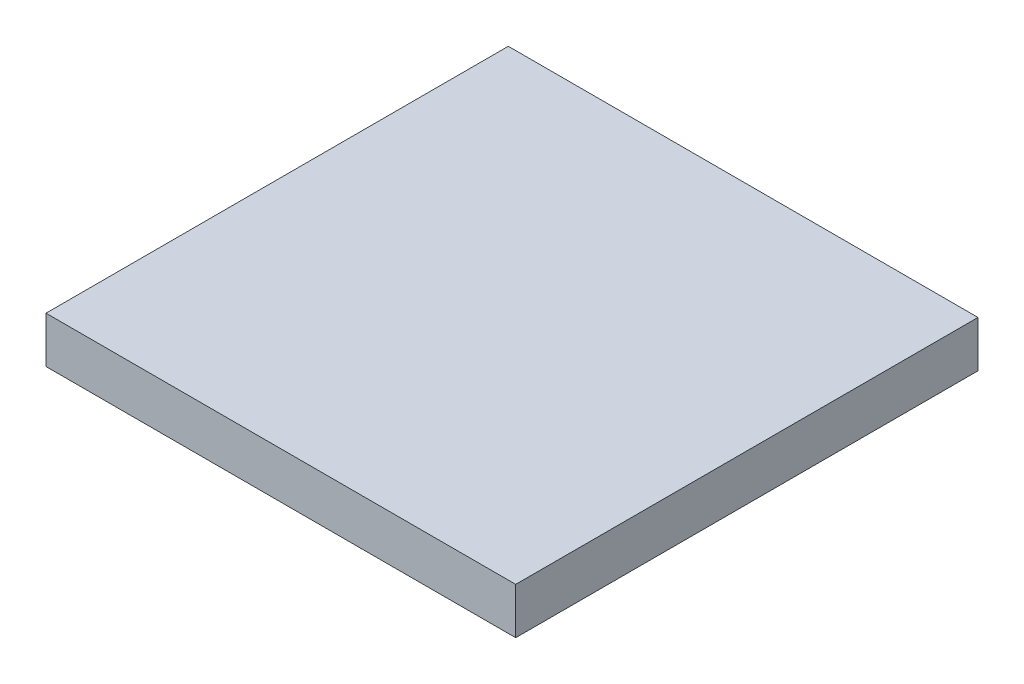
ISO-10303-21;
HEADER;
FILE_DESCRIPTION(('STEP AP214'),'2;1');
FILE_NAME('part.step','',(''),(''),'','','');
FILE_SCHEMA(('AUTOMOTIVE_DESIGN { 1 0 10303 214 1 1 1 1 }'));
ENDSEC;
DATA;
#1=APPLICATION_CONTEXT('core data for automotive mechanical design processes');
#2=APPLICATION_PROTOCOL_DEFINITION('international standard','automotive_design',2000,#1);
#3=PRODUCT_CONTEXT('',#1,'mechanical');
#4=PRODUCT('Part','Part','',(#3));
#5=PRODUCT_RELATED_PRODUCT_CATEGORY('part','',(#4));
#6=PRODUCT_DEFINITION_FORMATION('','',#4);
#7=PRODUCT_DEFINITION_CONTEXT('part definition',#1,'design');
#8=PRODUCT_DEFINITION('design','',#6,#7);
#9=PRODUCT_DEFINITION_SHAPE('','',#8);
#10=(LENGTH_UNIT() NAMED_UNIT(*) SI_UNIT(.MILLI.,.METRE.));
#11=(NAMED_UNIT(*) PLANE_ANGLE_UNIT() SI_UNIT($,.RADIAN.));
#12=(NAMED_UNIT(*) SI_UNIT($,.STERADIAN.) SOLID_ANGLE_UNIT());
#13=UNCERTAINTY_MEASURE_WITH_UNIT(LENGTH_MEASURE(1.E-05),#10,'distance_accuracy_value','');
#14=(GEOMETRIC_REPRESENTATION_CONTEXT(3) GLOBAL_UNCERTAINTY_ASSIGNED_CONTEXT((#13)) GLOBAL_UNIT_ASSIGNED_CONTEXT((#10,
#11,#12)) REPRESENTATION_CONTEXT('',''));
#15=CARTESIAN_POINT('',(0.,0.,0.));
#16=DIRECTION('',(0.,0.,1.));
#17=DIRECTION('',(1.,0.,0.));
#18=AXIS2_PLACEMENT_3D('',#15,#16,#17);
#19=CARTESIAN_POINT('',(25.4,5.,25.));
#20=DIRECTION('',(-1.,0.,0.));
#21=DIRECTION('',(0.,0.,1.));
#22=AXIS2_PLACEMENT_3D('',#19,#20,#21);
#23=PLANE('',#22);
#24=DIRECTION('',(0.,0.,-1.));
#25=VECTOR('',#24,1.);
#26=CARTESIAN_POINT('',(25.4,0.,25.));
#27=LINE('',#26,#25);
#28=CARTESIAN_POINT('',(25.4,0.,25.));
#29=VERTEX_POINT('',#28);
#30=CARTESIAN_POINT('',(25.4,0.,-25.));
#31=VERTEX_POINT('',#30);
#32=EDGE_CURVE('E96',#29,#31,#27,.T.);
#33=ORIENTED_EDGE('',*,*,#32,.T.);
#34=DIRECTION('',(0.,-1.,0.));
#35=VECTOR('',#34,1.);
#36=CARTESIAN_POINT('',(25.4,5.,-25.));
#37=LINE('',#36,#35);
#38=CARTESIAN_POINT('',(25.4,5.,-25.));
#39=VERTEX_POINT('',#38);
#40=EDGE_CURVE('E11',#39,#31,#37,.T.);
#41=ORIENTED_EDGE('',*,*,#40,.F.);
#42=DIRECTION('',(0.,0.,-1.));
#43=VECTOR('',#42,1.);
#44=CARTESIAN_POINT('',(25.4,5.,25.));
#45=LINE('',#44,#43);
#46=CARTESIAN_POINT('',(25.4,5.,25.));
#47=VERTEX_POINT('',#46);
#48=EDGE_CURVE('E84',#47,#39,#45,.T.);
#49=ORIENTED_EDGE('',*,*,#48,.F.);
#50=DIRECTION('',(0.,-1.,0.));
#51=VECTOR('',#50,1.);
#52=CARTESIAN_POINT('',(25.4,5.,25.));
#53=LINE('',#52,#51);
#54=EDGE_CURVE('E92',#47,#29,#53,.T.);
#55=ORIENTED_EDGE('',*,*,#54,.T.);
#56=EDGE_LOOP('',(#33,#41,#49,#55));
#57=FACE_BOUND('',#56,.T.);
#58=ADVANCED_FACE('F33',(#57),#23,.F.);
#59=CARTESIAN_POINT('',(-25.4,5.,-25.));
#60=DIRECTION('',(0.,0.,1.));
#61=DIRECTION('',(1.,0.,0.));
#62=AXIS2_PLACEMENT_3D('',#59,#60,#61);
#63=PLANE('',#62);
#64=DIRECTION('',(-1.,0.,0.));
#65=VECTOR('',#64,1.);
#66=CARTESIAN_POINT('',(-25.4,0.,-25.));
#67=LINE('',#66,#65);
#68=CARTESIAN_POINT('',(-25.4,0.,-25.));
#69=VERTEX_POINT('',#68);
#70=EDGE_CURVE('E88',#31,#69,#67,.T.);
#71=ORIENTED_EDGE('',*,*,#70,.T.);
#72=DIRECTION('',(0.,-1.,0.));
#73=VECTOR('',#72,1.);
#74=CARTESIAN_POINT('',(-25.4,5.,-25.));
#75=LINE('',#74,#73);
#76=CARTESIAN_POINT('',(-25.4,5.,-25.));
#77=VERTEX_POINT('',#76);
#78=EDGE_CURVE('E41',#77,#69,#75,.T.);
#79=ORIENTED_EDGE('',*,*,#78,.F.);
#80=DIRECTION('',(-1.,0.,0.));
#81=VECTOR('',#80,1.);
#82=CARTESIAN_POINT('',(-25.4,5.,-25.));
#83=LINE('',#82,#81);
#84=EDGE_CURVE('E79',#39,#77,#83,.T.);
#85=ORIENTED_EDGE('',*,*,#84,.F.);
#86=ORIENTED_EDGE('',*,*,#40,.T.);
#87=EDGE_LOOP('',(#71,#79,#85,#86));
#88=FACE_BOUND('',#87,.T.);
#89=ADVANCED_FACE('F87',(#88),#63,.F.);
#90=CARTESIAN_POINT('',(-25.4,5.,25.));
#91=DIRECTION('',(1.,0.,0.));
#92=DIRECTION('',(0.,0.,-1.));
#93=AXIS2_PLACEMENT_3D('',#90,#91,#92);
#94=PLANE('',#93);
#95=DIRECTION('',(0.,0.,1.));
#96=VECTOR('',#95,1.);
#97=CARTESIAN_POINT('',(-25.4,0.,25.));
#98=LINE('',#97,#96);
#99=CARTESIAN_POINT('',(-25.4,0.,25.));
#100=VERTEX_POINT('',#99);
#101=EDGE_CURVE('E66',#69,#100,#98,.T.);
#102=ORIENTED_EDGE('',*,*,#101,.T.);
#103=DIRECTION('',(0.,-1.,0.));
#104=VECTOR('',#103,1.);
#105=CARTESIAN_POINT('',(-25.4,5.,25.));
#106=LINE('',#105,#104);
#107=CARTESIAN_POINT('',(-25.4,5.,25.));
#108=VERTEX_POINT('',#107);
#109=EDGE_CURVE('E89',#108,#100,#106,.T.);
#110=ORIENTED_EDGE('',*,*,#109,.F.);
#111=DIRECTION('',(0.,0.,1.));
#112=VECTOR('',#111,1.);
#113=CARTESIAN_POINT('',(-25.4,5.,25.));
#114=LINE('',#113,#112);
#115=EDGE_CURVE('E82',#77,#108,#114,.T.);
#116=ORIENTED_EDGE('',*,*,#115,.F.);
#117=ORIENTED_EDGE('',*,*,#78,.T.);
#118=EDGE_LOOP('',(#102,#110,#116,#117));
#119=FACE_BOUND('',#118,.T.);
#120=ADVANCED_FACE('F90',(#119),#94,.F.);
#121=CARTESIAN_POINT('',(-25.4,5.,25.));
#122=DIRECTION('',(0.,0.,-1.));
#123=DIRECTION('',(-1.,0.,0.));
#124=AXIS2_PLACEMENT_3D('',#121,#122,#123);
#125=PLANE('',#124);
#126=DIRECTION('',(1.,0.,0.));
#127=VECTOR('',#126,1.);
#128=CARTESIAN_POINT('',(-25.4,0.,25.));
#129=LINE('',#128,#127);
#130=EDGE_CURVE('E72',#100,#29,#129,.T.);
#131=ORIENTED_EDGE('',*,*,#130,.T.);
#132=ORIENTED_EDGE('',*,*,#54,.F.);
#133=DIRECTION('',(1.,0.,0.));
#134=VECTOR('',#133,1.);
#135=CARTESIAN_POINT('',(-25.4,5.,25.));
#136=LINE('',#135,#134);
#137=EDGE_CURVE('E49',#108,#47,#136,.T.);
#138=ORIENTED_EDGE('',*,*,#137,.F.);
#139=ORIENTED_EDGE('',*,*,#109,.T.);
#140=EDGE_LOOP('',(#131,#132,#138,#139));
#141=FACE_BOUND('',#140,.T.);
#142=ADVANCED_FACE('F103',(#141),#125,.F.);
#143=CARTESIAN_POINT('',(0.,5.,0.));
#144=DIRECTION('',(0.,-1.,0.));
#145=DIRECTION('',(0.,0.,-1.));
#146=AXIS2_PLACEMENT_3D('',#143,#144,#145);
#147=PLANE('',#146);
#148=ORIENTED_EDGE('',*,*,#48,.T.);
#149=ORIENTED_EDGE('',*,*,#84,.T.);
#150=ORIENTED_EDGE('',*,*,#115,.T.);
#151=ORIENTED_EDGE('',*,*,#137,.T.);
#152=EDGE_LOOP('',(#148,#149,#150,#151));
#153=FACE_BOUND('',#152,.T.);
#154=ADVANCED_FACE('F80',(#153),#147,.F.);
#155=CARTESIAN_POINT('',(0.,0.,0.));
#156=DIRECTION('',(0.,-1.,0.));
#157=DIRECTION('',(0.,0.,-1.));
#158=AXIS2_PLACEMENT_3D('',#155,#156,#157);
#159=PLANE('',#158);
#160=ORIENTED_EDGE('',*,*,#32,.F.);
#161=ORIENTED_EDGE('',*,*,#130,.F.);
#162=ORIENTED_EDGE('',*,*,#101,.F.);
#163=ORIENTED_EDGE('',*,*,#70,.F.);
#164=EDGE_LOOP('',(#160,#161,#162,#163));
#165=FACE_BOUND('',#164,.T.);
#166=ADVANCED_FACE('F106',(#165),#159,.T.);
#167=CLOSED_SHELL('',(#58,#89,#120,#142,#154,#166));
#168=MANIFOLD_SOLID_BREP('B2',#167);
#169=ADVANCED_BREP_SHAPE_REPRESENTATION('',(#18,#168),#14);
#170=SHAPE_DEFINITION_REPRESENTATION(#9,#169);
ENDSEC;
END-ISO-10303-21;
